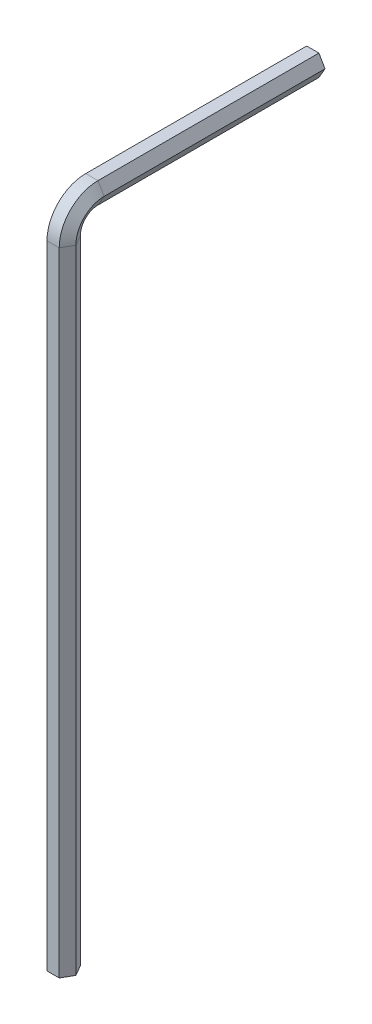
ISO-10303-21;
HEADER;
FILE_DESCRIPTION(('STEP AP214'),'2;1');
FILE_NAME('part.step','',(''),(''),'','','');
FILE_SCHEMA(('AUTOMOTIVE_DESIGN { 1 0 10303 214 1 1 1 1 }'));
ENDSEC;
DATA;
#1=APPLICATION_CONTEXT('core data for automotive mechanical design processes');
#2=APPLICATION_PROTOCOL_DEFINITION('international standard','automotive_design',2000,#1);
#3=PRODUCT_CONTEXT('',#1,'mechanical');
#4=PRODUCT('Part','Part','',(#3));
#5=PRODUCT_RELATED_PRODUCT_CATEGORY('part','',(#4));
#6=PRODUCT_DEFINITION_FORMATION('','',#4);
#7=PRODUCT_DEFINITION_CONTEXT('part definition',#1,'design');
#8=PRODUCT_DEFINITION('design','',#6,#7);
#9=PRODUCT_DEFINITION_SHAPE('','',#8);
#10=(LENGTH_UNIT() NAMED_UNIT(*) SI_UNIT(.MILLI.,.METRE.));
#11=(NAMED_UNIT(*) PLANE_ANGLE_UNIT() SI_UNIT($,.RADIAN.));
#12=(NAMED_UNIT(*) SI_UNIT($,.STERADIAN.) SOLID_ANGLE_UNIT());
#13=UNCERTAINTY_MEASURE_WITH_UNIT(LENGTH_MEASURE(1.E-05),#10,'distance_accuracy_value','');
#14=(GEOMETRIC_REPRESENTATION_CONTEXT(3) GLOBAL_UNCERTAINTY_ASSIGNED_CONTEXT((#13)) GLOBAL_UNIT_ASSIGNED_CONTEXT((#10,
#11,#12)) REPRESENTATION_CONTEXT('',''));
#15=CARTESIAN_POINT('',(0.,0.,0.));
#16=DIRECTION('',(0.,0.,1.));
#17=DIRECTION('',(1.,0.,0.));
#18=AXIS2_PLACEMENT_3D('',#15,#16,#17);
#19=CARTESIAN_POINT('',(0.,0.,0.));
#20=DIRECTION('',(0.,1.,0.));
#21=DIRECTION('',(0.,0.,1.));
#22=AXIS2_PLACEMENT_3D('',#19,#20,#21);
#23=PLANE('',#22);
#24=DIRECTION('',(0.499999999999995,0.,-0.866025403784441));
#25=VECTOR('',#24,1.);
#26=CARTESIAN_POINT('',(0.433012701892229,0.,0.749999999999997));
#27=LINE('',#26,#25);
#28=CARTESIAN_POINT('',(0.433012701892229,0.,0.749999999999997));
#29=VERTEX_POINT('',#28);
#30=CARTESIAN_POINT('',(0.866025403784441,0.,0.));
#31=VERTEX_POINT('',#30);
#32=EDGE_CURVE('E182',#29,#31,#27,.T.);
#33=ORIENTED_EDGE('',*,*,#32,.F.);
#34=DIRECTION('',(1.,0.,0.));
#35=VECTOR('',#34,1.);
#36=CARTESIAN_POINT('',(-0.433012701892213,0.,0.750000000000006));
#37=LINE('',#36,#35);
#38=CARTESIAN_POINT('',(-0.433012701892213,0.,0.750000000000006));
#39=VERTEX_POINT('',#38);
#40=EDGE_CURVE('E224',#39,#29,#37,.T.);
#41=ORIENTED_EDGE('',*,*,#40,.F.);
#42=DIRECTION('',(0.500000000000007,0.,0.866025403784435));
#43=VECTOR('',#42,1.);
#44=CARTESIAN_POINT('',(-0.866025403784441,0.,0.));
#45=LINE('',#44,#43);
#46=CARTESIAN_POINT('',(-0.866025403784441,0.,0.));
#47=VERTEX_POINT('',#46);
#48=EDGE_CURVE('E211',#47,#39,#45,.T.);
#49=ORIENTED_EDGE('',*,*,#48,.F.);
#50=DIRECTION('',(-0.499999999999995,0.,0.866025403784442));
#51=VECTOR('',#50,1.);
#52=CARTESIAN_POINT('',(-0.433012701892224,0.,-0.75));
#53=LINE('',#52,#51);
#54=CARTESIAN_POINT('',(-0.433012701892224,0.,-0.75));
#55=VERTEX_POINT('',#54);
#56=EDGE_CURVE('E134',#55,#47,#53,.T.);
#57=ORIENTED_EDGE('',*,*,#56,.F.);
#58=DIRECTION('',(-1.,0.,0.));
#59=VECTOR('',#58,1.);
#60=CARTESIAN_POINT('',(0.433012701892219,0.,-0.750000000000003));
#61=LINE('',#60,#59);
#62=CARTESIAN_POINT('',(0.433012701892219,0.,-0.750000000000003));
#63=VERTEX_POINT('',#62);
#64=EDGE_CURVE('E138',#63,#55,#61,.T.);
#65=ORIENTED_EDGE('',*,*,#64,.F.);
#66=DIRECTION('',(-0.500000000000001,0.,-0.866025403784438));
#67=VECTOR('',#66,1.);
#68=CARTESIAN_POINT('',(0.866025403784441,0.,0.));
#69=LINE('',#68,#67);
#70=EDGE_CURVE('E143',#31,#63,#69,.T.);
#71=ORIENTED_EDGE('',*,*,#70,.F.);
#72=EDGE_LOOP('',(#33,#41,#49,#57,#65,#71));
#73=FACE_BOUND('',#72,.T.);
#74=ADVANCED_FACE('F33',(#73),#23,.F.);
#75=CARTESIAN_POINT('',(0.,46.8,-17.65));
#76=DIRECTION('',(0.,0.,-1.));
#77=DIRECTION('',(0.,1.,0.));
#78=AXIS2_PLACEMENT_3D('',#75,#76,#77);
#79=PLANE('',#78);
#80=DIRECTION('',(0.499999999999995,-0.866025403784441,0.));
#81=VECTOR('',#80,1.);
#82=CARTESIAN_POINT('',(0.433012701892229,47.55,-17.65));
#83=LINE('',#82,#81);
#84=CARTESIAN_POINT('',(0.433012701892229,47.55,-17.65));
#85=VERTEX_POINT('',#84);
#86=CARTESIAN_POINT('',(0.866025403784441,46.8,-17.65));
#87=VERTEX_POINT('',#86);
#88=EDGE_CURVE('E154',#85,#87,#83,.T.);
#89=ORIENTED_EDGE('',*,*,#88,.T.);
#90=DIRECTION('',(-0.500000000000001,-0.866025403784438,0.));
#91=VECTOR('',#90,1.);
#92=CARTESIAN_POINT('',(0.866025403784441,46.8,-17.65));
#93=LINE('',#92,#91);
#94=CARTESIAN_POINT('',(0.433012701892219,46.05,-17.65));
#95=VERTEX_POINT('',#94);
#96=EDGE_CURVE('E157',#87,#95,#93,.T.);
#97=ORIENTED_EDGE('',*,*,#96,.T.);
#98=DIRECTION('',(-1.,0.,0.));
#99=VECTOR('',#98,1.);
#100=CARTESIAN_POINT('',(0.433012701892219,46.05,-17.65));
#101=LINE('',#100,#99);
#102=CARTESIAN_POINT('',(-0.433012701892224,46.05,-17.65));
#103=VERTEX_POINT('',#102);
#104=EDGE_CURVE('E197',#95,#103,#101,.T.);
#105=ORIENTED_EDGE('',*,*,#104,.T.);
#106=DIRECTION('',(-0.499999999999995,0.866025403784442,0.));
#107=VECTOR('',#106,1.);
#108=CARTESIAN_POINT('',(-0.433012701892224,46.05,-17.65));
#109=LINE('',#108,#107);
#110=CARTESIAN_POINT('',(-0.866025403784441,46.8,-17.65));
#111=VERTEX_POINT('',#110);
#112=EDGE_CURVE('E52',#103,#111,#109,.T.);
#113=ORIENTED_EDGE('',*,*,#112,.T.);
#114=DIRECTION('',(0.500000000000007,0.866025403784435,0.));
#115=VECTOR('',#114,1.);
#116=CARTESIAN_POINT('',(-0.866025403784441,46.8,-17.65));
#117=LINE('',#116,#115);
#118=CARTESIAN_POINT('',(-0.433012701892213,47.55,-17.65));
#119=VERTEX_POINT('',#118);
#120=EDGE_CURVE('E46',#111,#119,#117,.T.);
#121=ORIENTED_EDGE('',*,*,#120,.T.);
#122=DIRECTION('',(1.,0.,0.));
#123=VECTOR('',#122,1.);
#124=CARTESIAN_POINT('',(-0.433012701892213,47.55,-17.65));
#125=LINE('',#124,#123);
#126=EDGE_CURVE('E11',#119,#85,#125,.T.);
#127=ORIENTED_EDGE('',*,*,#126,.T.);
#128=EDGE_LOOP('',(#89,#97,#105,#113,#121,#127));
#129=FACE_BOUND('',#128,.T.);
#130=ADVANCED_FACE('F156',(#129),#79,.T.);
#131=CARTESIAN_POINT('',(0.433012701892229,0.,0.749999999999997));
#132=DIRECTION('',(0.866025403784442,0.,0.499999999999995));
#133=DIRECTION('',(0.499999999999995,0.,-0.866025403784441));
#134=AXIS2_PLACEMENT_3D('',#131,#132,#133);
#135=PLANE('',#134);
#136=DIRECTION('',(0.,1.,0.));
#137=VECTOR('',#136,1.);
#138=CARTESIAN_POINT('',(0.866025403784441,0.,0.));
#139=LINE('',#138,#137);
#140=CARTESIAN_POINT('',(0.866025403784441,44.8,0.));
#141=VERTEX_POINT('',#140);
#142=EDGE_CURVE('E187',#31,#141,#139,.T.);
#143=ORIENTED_EDGE('',*,*,#142,.T.);
#144=DIRECTION('',(0.499999999999995,0.,-0.866025403784441));
#145=VECTOR('',#144,1.);
#146=CARTESIAN_POINT('',(0.433012701892229,44.8,0.749999999999997));
#147=LINE('',#146,#145);
#148=CARTESIAN_POINT('',(0.433012701892229,44.8,0.749999999999997));
#149=VERTEX_POINT('',#148);
#150=EDGE_CURVE('E256',#149,#141,#147,.T.);
#151=ORIENTED_EDGE('',*,*,#150,.F.);
#152=DIRECTION('',(0.,1.,0.));
#153=VECTOR('',#152,1.);
#154=CARTESIAN_POINT('',(0.433012701892229,0.,0.749999999999997));
#155=LINE('',#154,#153);
#156=EDGE_CURVE('E238',#29,#149,#155,.T.);
#157=ORIENTED_EDGE('',*,*,#156,.F.);
#158=ORIENTED_EDGE('',*,*,#32,.T.);
#159=EDGE_LOOP('',(#143,#151,#157,#158));
#160=FACE_BOUND('',#159,.T.);
#161=ADVANCED_FACE('F263',(#160),#135,.T.);
#162=CARTESIAN_POINT('',(0.866025403784441,0.,0.));
#163=DIRECTION('',(0.866025403784438,0.,-0.500000000000001));
#164=DIRECTION('',(-0.500000000000001,0.,-0.866025403784438));
#165=AXIS2_PLACEMENT_3D('',#162,#163,#164);
#166=PLANE('',#165);
#167=DIRECTION('',(0.,1.,0.));
#168=VECTOR('',#167,1.);
#169=CARTESIAN_POINT('',(0.433012701892219,0.,-0.750000000000003));
#170=LINE('',#169,#168);
#171=CARTESIAN_POINT('',(0.433012701892219,44.8,-0.750000000000003));
#172=VERTEX_POINT('',#171);
#173=EDGE_CURVE('E186',#63,#172,#170,.T.);
#174=ORIENTED_EDGE('',*,*,#173,.T.);
#175=DIRECTION('',(-0.500000000000001,0.,-0.866025403784438));
#176=VECTOR('',#175,1.);
#177=CARTESIAN_POINT('',(0.866025403784441,44.8,0.));
#178=LINE('',#177,#176);
#179=EDGE_CURVE('E183',#141,#172,#178,.T.);
#180=ORIENTED_EDGE('',*,*,#179,.F.);
#181=ORIENTED_EDGE('',*,*,#142,.F.);
#182=ORIENTED_EDGE('',*,*,#70,.T.);
#183=EDGE_LOOP('',(#174,#180,#181,#182));
#184=FACE_BOUND('',#183,.T.);
#185=ADVANCED_FACE('F266',(#184),#166,.T.);
#186=CARTESIAN_POINT('',(0.433012701892219,0.,-0.750000000000003));
#187=DIRECTION('',(0.,0.,-1.));
#188=DIRECTION('',(-1.,0.,0.));
#189=AXIS2_PLACEMENT_3D('',#186,#187,#188);
#190=PLANE('',#189);
#191=DIRECTION('',(0.,1.,0.));
#192=VECTOR('',#191,1.);
#193=CARTESIAN_POINT('',(-0.433012701892224,0.,-0.75));
#194=LINE('',#193,#192);
#195=CARTESIAN_POINT('',(-0.433012701892224,44.8,-0.75));
#196=VERTEX_POINT('',#195);
#197=EDGE_CURVE('E200',#55,#196,#194,.T.);
#198=ORIENTED_EDGE('',*,*,#197,.T.);
#199=DIRECTION('',(-1.,0.,0.));
#200=VECTOR('',#199,1.);
#201=CARTESIAN_POINT('',(0.433012701892219,44.8,-0.750000000000003));
#202=LINE('',#201,#200);
#203=EDGE_CURVE('E190',#172,#196,#202,.T.);
#204=ORIENTED_EDGE('',*,*,#203,.F.);
#205=ORIENTED_EDGE('',*,*,#173,.F.);
#206=ORIENTED_EDGE('',*,*,#64,.T.);
#207=EDGE_LOOP('',(#198,#204,#205,#206));
#208=FACE_BOUND('',#207,.T.);
#209=ADVANCED_FACE('F320',(#208),#190,.T.);
#210=CARTESIAN_POINT('',(-0.433012701892224,0.,-0.75));
#211=DIRECTION('',(-0.866025403784442,0.,-0.499999999999995));
#212=DIRECTION('',(-0.499999999999995,0.,0.866025403784442));
#213=AXIS2_PLACEMENT_3D('',#210,#211,#212);
#214=PLANE('',#213);
#215=DIRECTION('',(0.,1.,0.));
#216=VECTOR('',#215,1.);
#217=CARTESIAN_POINT('',(-0.866025403784441,0.,0.));
#218=LINE('',#217,#216);
#219=CARTESIAN_POINT('',(-0.866025403784441,44.8,0.));
#220=VERTEX_POINT('',#219);
#221=EDGE_CURVE('E213',#47,#220,#218,.T.);
#222=ORIENTED_EDGE('',*,*,#221,.T.);
#223=DIRECTION('',(-0.499999999999995,0.,0.866025403784442));
#224=VECTOR('',#223,1.);
#225=CARTESIAN_POINT('',(-0.433012701892224,44.8,-0.75));
#226=LINE('',#225,#224);
#227=EDGE_CURVE('E203',#196,#220,#226,.T.);
#228=ORIENTED_EDGE('',*,*,#227,.F.);
#229=ORIENTED_EDGE('',*,*,#197,.F.);
#230=ORIENTED_EDGE('',*,*,#56,.T.);
#231=EDGE_LOOP('',(#222,#228,#229,#230));
#232=FACE_BOUND('',#231,.T.);
#233=ADVANCED_FACE('F328',(#232),#214,.T.);
#234=CARTESIAN_POINT('',(-0.866025403784441,0.,0.));
#235=DIRECTION('',(-0.866025403784435,0.,0.500000000000007));
#236=DIRECTION('',(0.500000000000007,0.,0.866025403784435));
#237=AXIS2_PLACEMENT_3D('',#234,#235,#236);
#238=PLANE('',#237);
#239=DIRECTION('',(0.,1.,0.));
#240=VECTOR('',#239,1.);
#241=CARTESIAN_POINT('',(-0.433012701892213,0.,0.750000000000006));
#242=LINE('',#241,#240);
#243=CARTESIAN_POINT('',(-0.433012701892213,44.8,0.750000000000006));
#244=VERTEX_POINT('',#243);
#245=EDGE_CURVE('E226',#39,#244,#242,.T.);
#246=ORIENTED_EDGE('',*,*,#245,.T.);
#247=DIRECTION('',(0.500000000000007,0.,0.866025403784435));
#248=VECTOR('',#247,1.);
#249=CARTESIAN_POINT('',(-0.866025403784441,44.8,0.));
#250=LINE('',#249,#248);
#251=EDGE_CURVE('E216',#220,#244,#250,.T.);
#252=ORIENTED_EDGE('',*,*,#251,.F.);
#253=ORIENTED_EDGE('',*,*,#221,.F.);
#254=ORIENTED_EDGE('',*,*,#48,.T.);
#255=EDGE_LOOP('',(#246,#252,#253,#254));
#256=FACE_BOUND('',#255,.T.);
#257=ADVANCED_FACE('F338',(#256),#238,.T.);
#258=CARTESIAN_POINT('',(-0.433012701892213,0.,0.750000000000006));
#259=DIRECTION('',(0.,0.,1.));
#260=DIRECTION('',(1.,0.,0.));
#261=AXIS2_PLACEMENT_3D('',#258,#259,#260);
#262=PLANE('',#261);
#263=DIRECTION('',(1.,0.,0.));
#264=VECTOR('',#263,1.);
#265=CARTESIAN_POINT('',(-0.433012701892213,44.8,0.750000000000006));
#266=LINE('',#265,#264);
#267=EDGE_CURVE('E229',#244,#149,#266,.T.);
#268=ORIENTED_EDGE('',*,*,#267,.F.);
#269=ORIENTED_EDGE('',*,*,#245,.F.);
#270=ORIENTED_EDGE('',*,*,#40,.T.);
#271=ORIENTED_EDGE('',*,*,#156,.T.);
#272=EDGE_LOOP('',(#268,#269,#270,#271));
#273=FACE_BOUND('',#272,.T.);
#274=ADVANCED_FACE('F279',(#273),#262,.T.);
#275=CARTESIAN_POINT('',(0.433012701892229,44.8,-2.));
#276=DIRECTION('',(-1.,0.,0.));
#277=DIRECTION('',(0.,0.,1.));
#278=AXIS2_PLACEMENT_3D('',#275,#276,#277);
#279=CONICAL_SURFACE('',#278,2.75,1.0471975511966);
#280=CARTESIAN_POINT('',(0.866025403784441,44.8,-2.));
#281=DIRECTION('',(-1.,0.,0.));
#282=DIRECTION('',(0.,0.,1.));
#283=AXIS2_PLACEMENT_3D('',#280,#281,#282);
#284=CIRCLE('',#283,2.);
#285=CARTESIAN_POINT('',(0.866025403784441,46.8,-2.00000000000001));
#286=VERTEX_POINT('',#285);
#287=EDGE_CURVE('E193',#141,#286,#284,.T.);
#288=ORIENTED_EDGE('',*,*,#287,.T.);
#289=DIRECTION('',(0.499999999999995,-0.866025403784441,0.));
#290=VECTOR('',#289,1.);
#291=CARTESIAN_POINT('',(0.433012701892229,47.55,-2.00000000000002));
#292=LINE('',#291,#290);
#293=CARTESIAN_POINT('',(0.433012701892229,47.55,-2.00000000000002));
#294=VERTEX_POINT('',#293);
#295=EDGE_CURVE('E175',#294,#286,#292,.T.);
#296=ORIENTED_EDGE('',*,*,#295,.F.);
#297=CARTESIAN_POINT('',(0.433012701892229,44.8,-2.));
#298=DIRECTION('',(-1.,0.,0.));
#299=DIRECTION('',(0.,0.,1.));
#300=AXIS2_PLACEMENT_3D('',#297,#298,#299);
#301=CIRCLE('',#300,2.75);
#302=EDGE_CURVE('E240',#149,#294,#301,.T.);
#303=ORIENTED_EDGE('',*,*,#302,.F.);
#304=ORIENTED_EDGE('',*,*,#150,.T.);
#305=EDGE_LOOP('',(#288,#296,#303,#304));
#306=FACE_BOUND('',#305,.T.);
#307=ADVANCED_FACE('F246',(#306),#279,.T.);
#308=CARTESIAN_POINT('',(0.866025403784441,44.8,-2.));
#309=DIRECTION('',(1.,0.,0.));
#310=DIRECTION('',(0.,0.,-1.));
#311=AXIS2_PLACEMENT_3D('',#308,#309,#310);
#312=CONICAL_SURFACE('',#311,2.,1.0471975511966);
#313=CARTESIAN_POINT('',(0.433012701892219,44.8,-2.));
#314=DIRECTION('',(-1.,0.,0.));
#315=DIRECTION('',(0.,0.,1.));
#316=AXIS2_PLACEMENT_3D('',#313,#314,#315);
#317=CIRCLE('',#316,1.25);
#318=CARTESIAN_POINT('',(0.433012701892219,46.05,-2.00000000000001));
#319=VERTEX_POINT('',#318);
#320=EDGE_CURVE('E121',#172,#319,#317,.T.);
#321=ORIENTED_EDGE('',*,*,#320,.T.);
#322=DIRECTION('',(-0.500000000000001,-0.866025403784438,0.));
#323=VECTOR('',#322,1.);
#324=CARTESIAN_POINT('',(0.866025403784441,46.8,-2.00000000000001));
#325=LINE('',#324,#323);
#326=EDGE_CURVE('E191',#286,#319,#325,.T.);
#327=ORIENTED_EDGE('',*,*,#326,.F.);
#328=ORIENTED_EDGE('',*,*,#287,.F.);
#329=ORIENTED_EDGE('',*,*,#179,.T.);
#330=EDGE_LOOP('',(#321,#327,#328,#329));
#331=FACE_BOUND('',#330,.T.);
#332=ADVANCED_FACE('F269',(#331),#312,.F.);
#333=CARTESIAN_POINT('',(0.,44.8,-2.));
#334=DIRECTION('',(-1.,0.,0.));
#335=DIRECTION('',(0.,0.,1.));
#336=AXIS2_PLACEMENT_3D('',#333,#334,#335);
#337=CYLINDRICAL_SURFACE('',#336,1.25);
#338=CARTESIAN_POINT('',(-0.433012701892224,44.8,-2.));
#339=DIRECTION('',(-1.,0.,0.));
#340=DIRECTION('',(0.,0.,1.));
#341=AXIS2_PLACEMENT_3D('',#338,#339,#340);
#342=CIRCLE('',#341,1.25);
#343=CARTESIAN_POINT('',(-0.433012701892224,46.05,-2.00000000000001));
#344=VERTEX_POINT('',#343);
#345=EDGE_CURVE('E112',#196,#344,#342,.T.);
#346=ORIENTED_EDGE('',*,*,#345,.T.);
#347=DIRECTION('',(-1.,0.,0.));
#348=VECTOR('',#347,1.);
#349=CARTESIAN_POINT('',(0.433012701892219,46.05,-2.00000000000001));
#350=LINE('',#349,#348);
#351=EDGE_CURVE('E194',#319,#344,#350,.T.);
#352=ORIENTED_EDGE('',*,*,#351,.F.);
#353=ORIENTED_EDGE('',*,*,#320,.F.);
#354=ORIENTED_EDGE('',*,*,#203,.T.);
#355=EDGE_LOOP('',(#346,#352,#353,#354));
#356=FACE_BOUND('',#355,.T.);
#357=ADVANCED_FACE('F271',(#356),#337,.F.);
#358=CARTESIAN_POINT('',(-0.433012701892224,44.8,-2.));
#359=DIRECTION('',(-1.,0.,0.));
#360=DIRECTION('',(0.,0.,1.));
#361=AXIS2_PLACEMENT_3D('',#358,#359,#360);
#362=CONICAL_SURFACE('',#361,1.25,1.0471975511966);
#363=CARTESIAN_POINT('',(-0.866025403784441,44.8,-2.));
#364=DIRECTION('',(-1.,0.,0.));
#365=DIRECTION('',(0.,0.,1.));
#366=AXIS2_PLACEMENT_3D('',#363,#364,#365);
#367=CIRCLE('',#366,2.00000000000001);
#368=CARTESIAN_POINT('',(-0.866025403784441,46.8,-2.00000000000001));
#369=VERTEX_POINT('',#368);
#370=EDGE_CURVE('E105',#220,#369,#367,.T.);
#371=ORIENTED_EDGE('',*,*,#370,.T.);
#372=DIRECTION('',(-0.499999999999995,0.866025403784442,0.));
#373=VECTOR('',#372,1.);
#374=CARTESIAN_POINT('',(-0.433012701892224,46.05,-2.00000000000001));
#375=LINE('',#374,#373);
#376=EDGE_CURVE('E207',#344,#369,#375,.T.);
#377=ORIENTED_EDGE('',*,*,#376,.F.);
#378=ORIENTED_EDGE('',*,*,#345,.F.);
#379=ORIENTED_EDGE('',*,*,#227,.T.);
#380=EDGE_LOOP('',(#371,#377,#378,#379));
#381=FACE_BOUND('',#380,.T.);
#382=ADVANCED_FACE('F277',(#381),#362,.F.);
#383=CARTESIAN_POINT('',(-0.866025403784441,44.8,-2.));
#384=DIRECTION('',(1.,0.,0.));
#385=DIRECTION('',(0.,0.,-1.));
#386=AXIS2_PLACEMENT_3D('',#383,#384,#385);
#387=CONICAL_SURFACE('',#386,2.00000000000001,1.04719755119659);
#388=CARTESIAN_POINT('',(-0.433012701892213,44.8,-2.));
#389=DIRECTION('',(-1.,0.,0.));
#390=DIRECTION('',(0.,0.,1.));
#391=AXIS2_PLACEMENT_3D('',#388,#389,#390);
#392=CIRCLE('',#391,2.75000000000001);
#393=CARTESIAN_POINT('',(-0.433012701892213,47.55,-2.00000000000002));
#394=VERTEX_POINT('',#393);
#395=EDGE_CURVE('E231',#244,#394,#392,.T.);
#396=ORIENTED_EDGE('',*,*,#395,.T.);
#397=DIRECTION('',(0.500000000000007,0.866025403784435,0.));
#398=VECTOR('',#397,1.);
#399=CARTESIAN_POINT('',(-0.866025403784441,46.8,-2.00000000000001));
#400=LINE('',#399,#398);
#401=EDGE_CURVE('E219',#369,#394,#400,.T.);
#402=ORIENTED_EDGE('',*,*,#401,.F.);
#403=ORIENTED_EDGE('',*,*,#370,.F.);
#404=ORIENTED_EDGE('',*,*,#251,.T.);
#405=EDGE_LOOP('',(#396,#402,#403,#404));
#406=FACE_BOUND('',#405,.T.);
#407=ADVANCED_FACE('F381',(#406),#387,.T.);
#408=CARTESIAN_POINT('',(0.,44.8,-2.));
#409=DIRECTION('',(-1.,0.,0.));
#410=DIRECTION('',(0.,0.,1.));
#411=AXIS2_PLACEMENT_3D('',#408,#409,#410);
#412=CYLINDRICAL_SURFACE('',#411,2.75);
#413=DIRECTION('',(1.,0.,0.));
#414=VECTOR('',#413,1.);
#415=CARTESIAN_POINT('',(-0.433012701892213,47.55,-2.00000000000002));
#416=LINE('',#415,#414);
#417=EDGE_CURVE('E180',#394,#294,#416,.T.);
#418=ORIENTED_EDGE('',*,*,#417,.F.);
#419=ORIENTED_EDGE('',*,*,#395,.F.);
#420=ORIENTED_EDGE('',*,*,#267,.T.);
#421=ORIENTED_EDGE('',*,*,#302,.T.);
#422=EDGE_LOOP('',(#418,#419,#420,#421));
#423=FACE_BOUND('',#422,.T.);
#424=ADVANCED_FACE('F249',(#423),#412,.T.);
#425=CARTESIAN_POINT('',(0.433012701892229,47.55,-2.00000000000001));
#426=DIRECTION('',(0.866025403784441,0.499999999999995,0.));
#427=DIRECTION('',(-0.499999999999995,0.866025403784442,0.));
#428=AXIS2_PLACEMENT_3D('',#425,#426,#427);
#429=PLANE('',#428);
#430=DIRECTION('',(0.,0.,-1.));
#431=VECTOR('',#430,1.);
#432=CARTESIAN_POINT('',(0.866025403784441,46.8,-2.00000000000001));
#433=LINE('',#432,#431);
#434=EDGE_CURVE('E162',#286,#87,#433,.T.);
#435=ORIENTED_EDGE('',*,*,#434,.T.);
#436=ORIENTED_EDGE('',*,*,#88,.F.);
#437=DIRECTION('',(0.,0.,-1.));
#438=VECTOR('',#437,1.);
#439=CARTESIAN_POINT('',(0.433012701892229,47.55,-2.00000000000001));
#440=LINE('',#439,#438);
#441=EDGE_CURVE('E163',#294,#85,#440,.T.);
#442=ORIENTED_EDGE('',*,*,#441,.F.);
#443=ORIENTED_EDGE('',*,*,#295,.T.);
#444=EDGE_LOOP('',(#435,#436,#442,#443));
#445=FACE_BOUND('',#444,.T.);
#446=ADVANCED_FACE('F173',(#445),#429,.T.);
#447=CARTESIAN_POINT('',(0.866025403784441,46.8,-2.00000000000001));
#448=DIRECTION('',(0.866025403784438,-0.500000000000001,0.));
#449=DIRECTION('',(0.500000000000001,0.866025403784438,0.));
#450=AXIS2_PLACEMENT_3D('',#447,#448,#449);
#451=PLANE('',#450);
#452=DIRECTION('',(0.,0.,-1.));
#453=VECTOR('',#452,1.);
#454=CARTESIAN_POINT('',(0.433012701892219,46.05,-2.00000000000001));
#455=LINE('',#454,#453);
#456=EDGE_CURVE('E170',#319,#95,#455,.T.);
#457=ORIENTED_EDGE('',*,*,#456,.T.);
#458=ORIENTED_EDGE('',*,*,#96,.F.);
#459=ORIENTED_EDGE('',*,*,#434,.F.);
#460=ORIENTED_EDGE('',*,*,#326,.T.);
#461=EDGE_LOOP('',(#457,#458,#459,#460));
#462=FACE_BOUND('',#461,.T.);
#463=ADVANCED_FACE('F167',(#462),#451,.T.);
#464=CARTESIAN_POINT('',(0.433012701892219,46.05,-2.00000000000001));
#465=DIRECTION('',(0.,-1.,0.));
#466=DIRECTION('',(1.,0.,0.));
#467=AXIS2_PLACEMENT_3D('',#464,#465,#466);
#468=PLANE('',#467);
#469=DIRECTION('',(0.,0.,-1.));
#470=VECTOR('',#469,1.);
#471=CARTESIAN_POINT('',(-0.433012701892224,46.05,-2.00000000000001));
#472=LINE('',#471,#470);
#473=EDGE_CURVE('E90',#344,#103,#472,.T.);
#474=ORIENTED_EDGE('',*,*,#473,.T.);
#475=ORIENTED_EDGE('',*,*,#104,.F.);
#476=ORIENTED_EDGE('',*,*,#456,.F.);
#477=ORIENTED_EDGE('',*,*,#351,.T.);
#478=EDGE_LOOP('',(#474,#475,#476,#477));
#479=FACE_BOUND('',#478,.T.);
#480=ADVANCED_FACE('F413',(#479),#468,.T.);
#481=CARTESIAN_POINT('',(-0.433012701892224,46.05,-2.00000000000001));
#482=DIRECTION('',(-0.866025403784442,-0.499999999999995,0.));
#483=DIRECTION('',(0.499999999999995,-0.866025403784442,0.));
#484=AXIS2_PLACEMENT_3D('',#481,#482,#483);
#485=PLANE('',#484);
#486=DIRECTION('',(0.,0.,-1.));
#487=VECTOR('',#486,1.);
#488=CARTESIAN_POINT('',(-0.866025403784441,46.8,-2.00000000000001));
#489=LINE('',#488,#487);
#490=EDGE_CURVE('E82',#369,#111,#489,.T.);
#491=ORIENTED_EDGE('',*,*,#490,.T.);
#492=ORIENTED_EDGE('',*,*,#112,.F.);
#493=ORIENTED_EDGE('',*,*,#473,.F.);
#494=ORIENTED_EDGE('',*,*,#376,.T.);
#495=EDGE_LOOP('',(#491,#492,#493,#494));
#496=FACE_BOUND('',#495,.T.);
#497=ADVANCED_FACE('F289',(#496),#485,.T.);
#498=CARTESIAN_POINT('',(-0.866025403784441,46.8,-2.00000000000001));
#499=DIRECTION('',(-0.866025403784435,0.500000000000007,0.));
#500=DIRECTION('',(-0.500000000000007,-0.866025403784435,0.));
#501=AXIS2_PLACEMENT_3D('',#498,#499,#500);
#502=PLANE('',#501);
#503=DIRECTION('',(0.,0.,-1.));
#504=VECTOR('',#503,1.);
#505=CARTESIAN_POINT('',(-0.433012701892213,47.55,-2.00000000000001));
#506=LINE('',#505,#504);
#507=EDGE_CURVE('E40',#394,#119,#506,.T.);
#508=ORIENTED_EDGE('',*,*,#507,.T.);
#509=ORIENTED_EDGE('',*,*,#120,.F.);
#510=ORIENTED_EDGE('',*,*,#490,.F.);
#511=ORIENTED_EDGE('',*,*,#401,.T.);
#512=EDGE_LOOP('',(#508,#509,#510,#511));
#513=FACE_BOUND('',#512,.T.);
#514=ADVANCED_FACE('F284',(#513),#502,.T.);
#515=CARTESIAN_POINT('',(-0.433012701892213,47.55,-2.00000000000001));
#516=DIRECTION('',(0.,1.,0.));
#517=DIRECTION('',(-1.,0.,0.));
#518=AXIS2_PLACEMENT_3D('',#515,#516,#517);
#519=PLANE('',#518);
#520=ORIENTED_EDGE('',*,*,#126,.F.);
#521=ORIENTED_EDGE('',*,*,#507,.F.);
#522=ORIENTED_EDGE('',*,*,#417,.T.);
#523=ORIENTED_EDGE('',*,*,#441,.T.);
#524=EDGE_LOOP('',(#520,#521,#522,#523));
#525=FACE_BOUND('',#524,.T.);
#526=ADVANCED_FACE('F241',(#525),#519,.T.);
#527=CLOSED_SHELL('',(#74,#130,#161,#185,#209,#233,#257,#274,#307,#332,#357,#382,#407,#424,#446,
#463,#480,#497,#514,#526));
#528=MANIFOLD_SOLID_BREP('B2',#527);
#529=ADVANCED_BREP_SHAPE_REPRESENTATION('',(#18,#528),#14);
#530=SHAPE_DEFINITION_REPRESENTATION(#9,#529);
ENDSEC;
END-ISO-10303-21;
